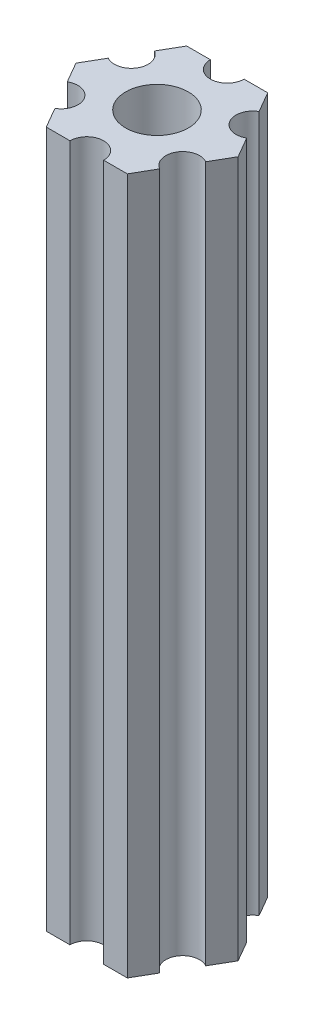
ISO-10303-21;
HEADER;
FILE_DESCRIPTION(('STEP AP214'),'2;1');
FILE_NAME('part.step','',(''),(''),'','','');
FILE_SCHEMA(('AUTOMOTIVE_DESIGN { 1 0 10303 214 1 1 1 1 }'));
ENDSEC;
DATA;
#1=APPLICATION_CONTEXT('core data for automotive mechanical design processes');
#2=APPLICATION_PROTOCOL_DEFINITION('international standard','automotive_design',2000,#1);
#3=PRODUCT_CONTEXT('',#1,'mechanical');
#4=PRODUCT('Part','Part','',(#3));
#5=PRODUCT_RELATED_PRODUCT_CATEGORY('part','',(#4));
#6=PRODUCT_DEFINITION_FORMATION('','',#4);
#7=PRODUCT_DEFINITION_CONTEXT('part definition',#1,'design');
#8=PRODUCT_DEFINITION('design','',#6,#7);
#9=PRODUCT_DEFINITION_SHAPE('','',#8);
#10=(LENGTH_UNIT() NAMED_UNIT(*) SI_UNIT(.MILLI.,.METRE.));
#11=(NAMED_UNIT(*) PLANE_ANGLE_UNIT() SI_UNIT($,.RADIAN.));
#12=(NAMED_UNIT(*) SI_UNIT($,.STERADIAN.) SOLID_ANGLE_UNIT());
#13=UNCERTAINTY_MEASURE_WITH_UNIT(LENGTH_MEASURE(1.E-05),#10,'distance_accuracy_value','');
#14=(GEOMETRIC_REPRESENTATION_CONTEXT(3) GLOBAL_UNCERTAINTY_ASSIGNED_CONTEXT((#13)) GLOBAL_UNIT_ASSIGNED_CONTEXT((#10,
#11,#12)) REPRESENTATION_CONTEXT('',''));
#15=CARTESIAN_POINT('',(0.,0.,0.));
#16=DIRECTION('',(0.,0.,1.));
#17=DIRECTION('',(1.,0.,0.));
#18=AXIS2_PLACEMENT_3D('',#15,#16,#17);
#19=CARTESIAN_POINT('',(5.41265877365274,23.,3.125));
#20=DIRECTION('',(0.,1.,0.));
#21=DIRECTION('',(0.,0.,1.));
#22=AXIS2_PLACEMENT_3D('',#19,#20,#21);
#23=CYLINDRICAL_SURFACE('',#22,1.5);
#24=CARTESIAN_POINT('',(5.41265877365274,85.,3.125));
#25=DIRECTION('',(0.,-1.,0.));
#26=DIRECTION('',(0.,0.,-1.));
#27=AXIS2_PLACEMENT_3D('',#24,#25,#26);
#28=CIRCLE('',#27,1.5);
#29=CARTESIAN_POINT('',(4.66265877365274,85.,4.42403810567666));
#30=VERTEX_POINT('',#29);
#31=CARTESIAN_POINT('',(6.16265877365274,85.,1.82596189432335));
#32=VERTEX_POINT('',#31);
#33=EDGE_CURVE('E194',#30,#32,#28,.T.);
#34=ORIENTED_EDGE('',*,*,#33,.F.);
#35=DIRECTION('',(0.,1.,0.));
#36=VECTOR('',#35,1.);
#37=CARTESIAN_POINT('',(4.66265877365274,23.,4.42403810567666));
#38=LINE('',#37,#36);
#39=CARTESIAN_POINT('',(4.66265877365274,23.,4.42403810567666));
#40=VERTEX_POINT('',#39);
#41=EDGE_CURVE('E11',#40,#30,#38,.T.);
#42=ORIENTED_EDGE('',*,*,#41,.F.);
#43=CARTESIAN_POINT('',(5.41265877365274,23.,3.125));
#44=DIRECTION('',(0.,-1.,0.));
#45=DIRECTION('',(0.,0.,-1.));
#46=AXIS2_PLACEMENT_3D('',#43,#44,#45);
#47=CIRCLE('',#46,1.5);
#48=CARTESIAN_POINT('',(6.16265877365274,23.,1.82596189432335));
#49=VERTEX_POINT('',#48);
#50=EDGE_CURVE('E245',#40,#49,#47,.T.);
#51=ORIENTED_EDGE('',*,*,#50,.T.);
#52=DIRECTION('',(0.,1.,0.));
#53=VECTOR('',#52,1.);
#54=CARTESIAN_POINT('',(6.16265877365274,23.,1.82596189432335));
#55=LINE('',#54,#53);
#56=EDGE_CURVE('E40',#49,#32,#55,.T.);
#57=ORIENTED_EDGE('',*,*,#56,.T.);
#58=EDGE_LOOP('',(#34,#42,#51,#57));
#59=FACE_BOUND('',#58,.T.);
#60=ADVANCED_FACE('F37',(#59),#23,.F.);
#61=CARTESIAN_POINT('',(3.60843918243516,23.,6.25));
#62=DIRECTION('',(0.866025403784439,0.,0.5));
#63=DIRECTION('',(0.5,0.,-0.866025403784439));
#64=AXIS2_PLACEMENT_3D('',#61,#62,#63);
#65=PLANE('',#64);
#66=DIRECTION('',(0.5,0.,-0.866025403784439));
#67=VECTOR('',#66,1.);
#68=CARTESIAN_POINT('',(3.60843918243516,85.,6.25));
#69=LINE('',#68,#67);
#70=CARTESIAN_POINT('',(3.60843918243516,85.,6.25));
#71=VERTEX_POINT('',#70);
#72=EDGE_CURVE('E243',#71,#30,#69,.T.);
#73=ORIENTED_EDGE('',*,*,#72,.F.);
#74=DIRECTION('',(0.,1.,0.));
#75=VECTOR('',#74,1.);
#76=CARTESIAN_POINT('',(3.60843918243516,23.,6.25));
#77=LINE('',#76,#75);
#78=CARTESIAN_POINT('',(3.60843918243516,23.,6.25));
#79=VERTEX_POINT('',#78);
#80=EDGE_CURVE('E46',#79,#71,#77,.T.);
#81=ORIENTED_EDGE('',*,*,#80,.F.);
#82=DIRECTION('',(0.5,0.,-0.866025403784439));
#83=VECTOR('',#82,1.);
#84=CARTESIAN_POINT('',(3.60843918243516,23.,6.25));
#85=LINE('',#84,#83);
#86=EDGE_CURVE('E184',#79,#40,#85,.T.);
#87=ORIENTED_EDGE('',*,*,#86,.T.);
#88=ORIENTED_EDGE('',*,*,#41,.T.);
#89=EDGE_LOOP('',(#73,#81,#87,#88));
#90=FACE_BOUND('',#89,.T.);
#91=ADVANCED_FACE('F277',(#90),#65,.T.);
#92=CARTESIAN_POINT('',(1.5,23.,6.25));
#93=DIRECTION('',(0.,0.,1.));
#94=DIRECTION('',(1.,0.,0.));
#95=AXIS2_PLACEMENT_3D('',#92,#93,#94);
#96=PLANE('',#95);
#97=DIRECTION('',(1.,0.,0.));
#98=VECTOR('',#97,1.);
#99=CARTESIAN_POINT('',(1.5,85.,6.25));
#100=LINE('',#99,#98);
#101=CARTESIAN_POINT('',(1.5,85.,6.25));
#102=VERTEX_POINT('',#101);
#103=EDGE_CURVE('E171',#102,#71,#100,.T.);
#104=ORIENTED_EDGE('',*,*,#103,.F.);
#105=DIRECTION('',(0.,1.,0.));
#106=VECTOR('',#105,1.);
#107=CARTESIAN_POINT('',(1.5,23.,6.25));
#108=LINE('',#107,#106);
#109=CARTESIAN_POINT('',(1.5,23.,6.25));
#110=VERTEX_POINT('',#109);
#111=EDGE_CURVE('E166',#110,#102,#108,.T.);
#112=ORIENTED_EDGE('',*,*,#111,.F.);
#113=DIRECTION('',(1.,0.,0.));
#114=VECTOR('',#113,1.);
#115=CARTESIAN_POINT('',(1.5,23.,6.25));
#116=LINE('',#115,#114);
#117=EDGE_CURVE('E169',#110,#79,#116,.T.);
#118=ORIENTED_EDGE('',*,*,#117,.T.);
#119=ORIENTED_EDGE('',*,*,#80,.T.);
#120=EDGE_LOOP('',(#104,#112,#118,#119));
#121=FACE_BOUND('',#120,.T.);
#122=ADVANCED_FACE('F168',(#121),#96,.T.);
#123=CARTESIAN_POINT('',(0.,23.,6.25));
#124=DIRECTION('',(0.,1.,0.));
#125=DIRECTION('',(0.,0.,1.));
#126=AXIS2_PLACEMENT_3D('',#123,#124,#125);
#127=CYLINDRICAL_SURFACE('',#126,1.5);
#128=CARTESIAN_POINT('',(0.,85.,6.25));
#129=DIRECTION('',(0.,-1.,0.));
#130=DIRECTION('',(0.,0.,-1.));
#131=AXIS2_PLACEMENT_3D('',#128,#129,#130);
#132=CIRCLE('',#131,1.5);
#133=CARTESIAN_POINT('',(-1.5,85.,6.25));
#134=VERTEX_POINT('',#133);
#135=EDGE_CURVE('E240',#134,#102,#132,.T.);
#136=ORIENTED_EDGE('',*,*,#135,.F.);
#137=DIRECTION('',(0.,1.,0.));
#138=VECTOR('',#137,1.);
#139=CARTESIAN_POINT('',(-1.5,23.,6.25));
#140=LINE('',#139,#138);
#141=CARTESIAN_POINT('',(-1.5,23.,6.25));
#142=VERTEX_POINT('',#141);
#143=EDGE_CURVE('E176',#142,#134,#140,.T.);
#144=ORIENTED_EDGE('',*,*,#143,.F.);
#145=CARTESIAN_POINT('',(0.,23.,6.25));
#146=DIRECTION('',(0.,-1.,0.));
#147=DIRECTION('',(0.,0.,-1.));
#148=AXIS2_PLACEMENT_3D('',#145,#146,#147);
#149=CIRCLE('',#148,1.5);
#150=EDGE_CURVE('E182',#142,#110,#149,.T.);
#151=ORIENTED_EDGE('',*,*,#150,.T.);
#152=ORIENTED_EDGE('',*,*,#111,.T.);
#153=EDGE_LOOP('',(#136,#144,#151,#152));
#154=FACE_BOUND('',#153,.T.);
#155=ADVANCED_FACE('F186',(#154),#127,.F.);
#156=CARTESIAN_POINT('',(-3.60843918243516,23.,6.25));
#157=DIRECTION('',(0.,0.,1.));
#158=DIRECTION('',(1.,0.,0.));
#159=AXIS2_PLACEMENT_3D('',#156,#157,#158);
#160=PLANE('',#159);
#161=DIRECTION('',(1.,0.,0.));
#162=VECTOR('',#161,1.);
#163=CARTESIAN_POINT('',(-3.60843918243516,85.,6.25));
#164=LINE('',#163,#162);
#165=CARTESIAN_POINT('',(-3.60843918243516,85.,6.25));
#166=VERTEX_POINT('',#165);
#167=EDGE_CURVE('E237',#166,#134,#164,.T.);
#168=ORIENTED_EDGE('',*,*,#167,.F.);
#169=DIRECTION('',(0.,1.,0.));
#170=VECTOR('',#169,1.);
#171=CARTESIAN_POINT('',(-3.60843918243516,23.,6.25));
#172=LINE('',#171,#170);
#173=CARTESIAN_POINT('',(-3.60843918243516,23.,6.25));
#174=VERTEX_POINT('',#173);
#175=EDGE_CURVE('E249',#174,#166,#172,.T.);
#176=ORIENTED_EDGE('',*,*,#175,.F.);
#177=DIRECTION('',(1.,0.,0.));
#178=VECTOR('',#177,1.);
#179=CARTESIAN_POINT('',(-3.60843918243516,23.,6.25));
#180=LINE('',#179,#178);
#181=EDGE_CURVE('E187',#174,#142,#180,.T.);
#182=ORIENTED_EDGE('',*,*,#181,.T.);
#183=ORIENTED_EDGE('',*,*,#143,.T.);
#184=EDGE_LOOP('',(#168,#176,#182,#183));
#185=FACE_BOUND('',#184,.T.);
#186=ADVANCED_FACE('F290',(#185),#160,.T.);
#187=CARTESIAN_POINT('',(-4.66265877365274,23.,4.42403810567666));
#188=DIRECTION('',(-0.866025403784439,0.,0.5));
#189=DIRECTION('',(0.5,0.,0.866025403784439));
#190=AXIS2_PLACEMENT_3D('',#187,#188,#189);
#191=PLANE('',#190);
#192=DIRECTION('',(0.5,0.,0.866025403784439));
#193=VECTOR('',#192,1.);
#194=CARTESIAN_POINT('',(-4.66265877365274,85.,4.42403810567666));
#195=LINE('',#194,#193);
#196=CARTESIAN_POINT('',(-4.66265877365274,85.,4.42403810567666));
#197=VERTEX_POINT('',#196);
#198=EDGE_CURVE('E234',#197,#166,#195,.T.);
#199=ORIENTED_EDGE('',*,*,#198,.F.);
#200=DIRECTION('',(0.,1.,0.));
#201=VECTOR('',#200,1.);
#202=CARTESIAN_POINT('',(-4.66265877365274,23.,4.42403810567666));
#203=LINE('',#202,#201);
#204=CARTESIAN_POINT('',(-4.66265877365274,23.,4.42403810567666));
#205=VERTEX_POINT('',#204);
#206=EDGE_CURVE('E251',#205,#197,#203,.T.);
#207=ORIENTED_EDGE('',*,*,#206,.F.);
#208=DIRECTION('',(0.5,0.,0.866025403784439));
#209=VECTOR('',#208,1.);
#210=CARTESIAN_POINT('',(-4.66265877365274,23.,4.42403810567666));
#211=LINE('',#210,#209);
#212=EDGE_CURVE('E189',#205,#174,#211,.T.);
#213=ORIENTED_EDGE('',*,*,#212,.T.);
#214=ORIENTED_EDGE('',*,*,#175,.T.);
#215=EDGE_LOOP('',(#199,#207,#213,#214));
#216=FACE_BOUND('',#215,.T.);
#217=ADVANCED_FACE('F293',(#216),#191,.T.);
#218=CARTESIAN_POINT('',(-5.41265877365274,23.,3.125));
#219=DIRECTION('',(0.,1.,0.));
#220=DIRECTION('',(0.,0.,1.));
#221=AXIS2_PLACEMENT_3D('',#218,#219,#220);
#222=CYLINDRICAL_SURFACE('',#221,1.5);
#223=CARTESIAN_POINT('',(-5.41265877365274,85.,3.125));
#224=DIRECTION('',(0.,-1.,0.));
#225=DIRECTION('',(0.,0.,-1.));
#226=AXIS2_PLACEMENT_3D('',#223,#224,#225);
#227=CIRCLE('',#226,1.5);
#228=CARTESIAN_POINT('',(-6.16265877365274,85.,1.82596189432335));
#229=VERTEX_POINT('',#228);
#230=EDGE_CURVE('E231',#229,#197,#227,.T.);
#231=ORIENTED_EDGE('',*,*,#230,.F.);
#232=DIRECTION('',(0.,1.,0.));
#233=VECTOR('',#232,1.);
#234=CARTESIAN_POINT('',(-6.16265877365274,23.,1.82596189432335));
#235=LINE('',#234,#233);
#236=CARTESIAN_POINT('',(-6.16265877365274,23.,1.82596189432335));
#237=VERTEX_POINT('',#236);
#238=EDGE_CURVE('E253',#237,#229,#235,.T.);
#239=ORIENTED_EDGE('',*,*,#238,.F.);
#240=CARTESIAN_POINT('',(-5.41265877365274,23.,3.125));
#241=DIRECTION('',(0.,-1.,0.));
#242=DIRECTION('',(0.,0.,-1.));
#243=AXIS2_PLACEMENT_3D('',#240,#241,#242);
#244=CIRCLE('',#243,1.5);
#245=EDGE_CURVE('E398',#237,#205,#244,.T.);
#246=ORIENTED_EDGE('',*,*,#245,.T.);
#247=ORIENTED_EDGE('',*,*,#206,.T.);
#248=EDGE_LOOP('',(#231,#239,#246,#247));
#249=FACE_BOUND('',#248,.T.);
#250=ADVANCED_FACE('F297',(#249),#222,.F.);
#251=CARTESIAN_POINT('',(-7.21687836487032,23.,0.));
#252=DIRECTION('',(-0.86602540378444,0.,0.499999999999998));
#253=DIRECTION('',(0.499999999999998,0.,0.86602540378444));
#254=AXIS2_PLACEMENT_3D('',#251,#252,#253);
#255=PLANE('',#254);
#256=DIRECTION('',(0.499999999999998,0.,0.86602540378444));
#257=VECTOR('',#256,1.);
#258=CARTESIAN_POINT('',(-7.21687836487032,85.,0.));
#259=LINE('',#258,#257);
#260=CARTESIAN_POINT('',(-7.21687836487032,85.,0.));
#261=VERTEX_POINT('',#260);
#262=EDGE_CURVE('E228',#261,#229,#259,.T.);
#263=ORIENTED_EDGE('',*,*,#262,.F.);
#264=DIRECTION('',(0.,1.,0.));
#265=VECTOR('',#264,1.);
#266=CARTESIAN_POINT('',(-7.21687836487032,23.,0.));
#267=LINE('',#266,#265);
#268=CARTESIAN_POINT('',(-7.21687836487032,23.,0.));
#269=VERTEX_POINT('',#268);
#270=EDGE_CURVE('E255',#269,#261,#267,.T.);
#271=ORIENTED_EDGE('',*,*,#270,.F.);
#272=DIRECTION('',(0.499999999999998,0.,0.86602540378444));
#273=VECTOR('',#272,1.);
#274=CARTESIAN_POINT('',(-7.21687836487032,23.,0.));
#275=LINE('',#274,#273);
#276=EDGE_CURVE('E395',#269,#237,#275,.T.);
#277=ORIENTED_EDGE('',*,*,#276,.T.);
#278=ORIENTED_EDGE('',*,*,#238,.T.);
#279=EDGE_LOOP('',(#263,#271,#277,#278));
#280=FACE_BOUND('',#279,.T.);
#281=ADVANCED_FACE('F301',(#280),#255,.T.);
#282=CARTESIAN_POINT('',(-6.16265877365274,23.,-1.82596189432334));
#283=DIRECTION('',(-0.866025403784438,0.,-0.5));
#284=DIRECTION('',(-0.5,0.,0.866025403784438));
#285=AXIS2_PLACEMENT_3D('',#282,#283,#284);
#286=PLANE('',#285);
#287=DIRECTION('',(-0.5,0.,0.866025403784438));
#288=VECTOR('',#287,1.);
#289=CARTESIAN_POINT('',(-6.16265877365274,85.,-1.82596189432334));
#290=LINE('',#289,#288);
#291=CARTESIAN_POINT('',(-6.16265877365274,85.,-1.82596189432334));
#292=VERTEX_POINT('',#291);
#293=EDGE_CURVE('E225',#292,#261,#290,.T.);
#294=ORIENTED_EDGE('',*,*,#293,.F.);
#295=DIRECTION('',(0.,1.,0.));
#296=VECTOR('',#295,1.);
#297=CARTESIAN_POINT('',(-6.16265877365274,23.,-1.82596189432334));
#298=LINE('',#297,#296);
#299=CARTESIAN_POINT('',(-6.16265877365274,23.,-1.82596189432334));
#300=VERTEX_POINT('',#299);
#301=EDGE_CURVE('E257',#300,#292,#298,.T.);
#302=ORIENTED_EDGE('',*,*,#301,.F.);
#303=DIRECTION('',(-0.5,0.,0.866025403784438));
#304=VECTOR('',#303,1.);
#305=CARTESIAN_POINT('',(-6.16265877365274,23.,-1.82596189432334));
#306=LINE('',#305,#304);
#307=EDGE_CURVE('E392',#300,#269,#306,.T.);
#308=ORIENTED_EDGE('',*,*,#307,.T.);
#309=ORIENTED_EDGE('',*,*,#270,.T.);
#310=EDGE_LOOP('',(#294,#302,#308,#309));
#311=FACE_BOUND('',#310,.T.);
#312=ADVANCED_FACE('F305',(#311),#286,.T.);
#313=CARTESIAN_POINT('',(-5.41265877365274,23.,-3.125));
#314=DIRECTION('',(0.,1.,0.));
#315=DIRECTION('',(0.,0.,1.));
#316=AXIS2_PLACEMENT_3D('',#313,#314,#315);
#317=CYLINDRICAL_SURFACE('',#316,1.5);
#318=CARTESIAN_POINT('',(-5.41265877365274,85.,-3.125));
#319=DIRECTION('',(0.,-1.,0.));
#320=DIRECTION('',(0.,0.,-1.));
#321=AXIS2_PLACEMENT_3D('',#318,#319,#320);
#322=CIRCLE('',#321,1.5);
#323=CARTESIAN_POINT('',(-4.66265877365274,85.,-4.42403810567666));
#324=VERTEX_POINT('',#323);
#325=EDGE_CURVE('E222',#324,#292,#322,.T.);
#326=ORIENTED_EDGE('',*,*,#325,.F.);
#327=DIRECTION('',(0.,1.,0.));
#328=VECTOR('',#327,1.);
#329=CARTESIAN_POINT('',(-4.66265877365274,23.,-4.42403810567666));
#330=LINE('',#329,#328);
#331=CARTESIAN_POINT('',(-4.66265877365274,23.,-4.42403810567666));
#332=VERTEX_POINT('',#331);
#333=EDGE_CURVE('E259',#332,#324,#330,.T.);
#334=ORIENTED_EDGE('',*,*,#333,.F.);
#335=CARTESIAN_POINT('',(-5.41265877365274,23.,-3.125));
#336=DIRECTION('',(0.,-1.,0.));
#337=DIRECTION('',(0.,0.,-1.));
#338=AXIS2_PLACEMENT_3D('',#335,#336,#337);
#339=CIRCLE('',#338,1.5);
#340=EDGE_CURVE('E389',#332,#300,#339,.T.);
#341=ORIENTED_EDGE('',*,*,#340,.T.);
#342=ORIENTED_EDGE('',*,*,#301,.T.);
#343=EDGE_LOOP('',(#326,#334,#341,#342));
#344=FACE_BOUND('',#343,.T.);
#345=ADVANCED_FACE('F309',(#344),#317,.F.);
#346=CARTESIAN_POINT('',(-3.60843918243516,23.,-6.25));
#347=DIRECTION('',(-0.866025403784439,0.,-0.5));
#348=DIRECTION('',(-0.5,0.,0.866025403784439));
#349=AXIS2_PLACEMENT_3D('',#346,#347,#348);
#350=PLANE('',#349);
#351=DIRECTION('',(-0.5,0.,0.866025403784439));
#352=VECTOR('',#351,1.);
#353=CARTESIAN_POINT('',(-3.60843918243516,85.,-6.25));
#354=LINE('',#353,#352);
#355=CARTESIAN_POINT('',(-3.60843918243516,85.,-6.25));
#356=VERTEX_POINT('',#355);
#357=EDGE_CURVE('E219',#356,#324,#354,.T.);
#358=ORIENTED_EDGE('',*,*,#357,.F.);
#359=DIRECTION('',(0.,1.,0.));
#360=VECTOR('',#359,1.);
#361=CARTESIAN_POINT('',(-3.60843918243516,23.,-6.25));
#362=LINE('',#361,#360);
#363=CARTESIAN_POINT('',(-3.60843918243516,23.,-6.25));
#364=VERTEX_POINT('',#363);
#365=EDGE_CURVE('E261',#364,#356,#362,.T.);
#366=ORIENTED_EDGE('',*,*,#365,.F.);
#367=DIRECTION('',(-0.5,0.,0.866025403784439));
#368=VECTOR('',#367,1.);
#369=CARTESIAN_POINT('',(-3.60843918243516,23.,-6.25));
#370=LINE('',#369,#368);
#371=EDGE_CURVE('E386',#364,#332,#370,.T.);
#372=ORIENTED_EDGE('',*,*,#371,.T.);
#373=ORIENTED_EDGE('',*,*,#333,.T.);
#374=EDGE_LOOP('',(#358,#366,#372,#373));
#375=FACE_BOUND('',#374,.T.);
#376=ADVANCED_FACE('F313',(#375),#350,.T.);
#377=CARTESIAN_POINT('',(-1.5,23.,-6.25));
#378=DIRECTION('',(0.,0.,-1.));
#379=DIRECTION('',(-1.,0.,0.));
#380=AXIS2_PLACEMENT_3D('',#377,#378,#379);
#381=PLANE('',#380);
#382=DIRECTION('',(-1.,0.,0.));
#383=VECTOR('',#382,1.);
#384=CARTESIAN_POINT('',(-1.5,85.,-6.25));
#385=LINE('',#384,#383);
#386=CARTESIAN_POINT('',(-1.5,85.,-6.25));
#387=VERTEX_POINT('',#386);
#388=EDGE_CURVE('E216',#387,#356,#385,.T.);
#389=ORIENTED_EDGE('',*,*,#388,.F.);
#390=DIRECTION('',(0.,1.,0.));
#391=VECTOR('',#390,1.);
#392=CARTESIAN_POINT('',(-1.5,23.,-6.25));
#393=LINE('',#392,#391);
#394=CARTESIAN_POINT('',(-1.5,23.,-6.25));
#395=VERTEX_POINT('',#394);
#396=EDGE_CURVE('E263',#395,#387,#393,.T.);
#397=ORIENTED_EDGE('',*,*,#396,.F.);
#398=DIRECTION('',(-1.,0.,0.));
#399=VECTOR('',#398,1.);
#400=CARTESIAN_POINT('',(-1.5,23.,-6.25));
#401=LINE('',#400,#399);
#402=EDGE_CURVE('E383',#395,#364,#401,.T.);
#403=ORIENTED_EDGE('',*,*,#402,.T.);
#404=ORIENTED_EDGE('',*,*,#365,.T.);
#405=EDGE_LOOP('',(#389,#397,#403,#404));
#406=FACE_BOUND('',#405,.T.);
#407=ADVANCED_FACE('F317',(#406),#381,.T.);
#408=CARTESIAN_POINT('',(0.,23.,-6.25));
#409=DIRECTION('',(0.,1.,0.));
#410=DIRECTION('',(0.,0.,1.));
#411=AXIS2_PLACEMENT_3D('',#408,#409,#410);
#412=CYLINDRICAL_SURFACE('',#411,1.5);
#413=CARTESIAN_POINT('',(0.,85.,-6.25));
#414=DIRECTION('',(0.,-1.,0.));
#415=DIRECTION('',(0.,0.,-1.));
#416=AXIS2_PLACEMENT_3D('',#413,#414,#415);
#417=CIRCLE('',#416,1.5);
#418=CARTESIAN_POINT('',(1.5,85.,-6.25));
#419=VERTEX_POINT('',#418);
#420=EDGE_CURVE('E213',#419,#387,#417,.T.);
#421=ORIENTED_EDGE('',*,*,#420,.F.);
#422=DIRECTION('',(0.,1.,0.));
#423=VECTOR('',#422,1.);
#424=CARTESIAN_POINT('',(1.5,23.,-6.25));
#425=LINE('',#424,#423);
#426=CARTESIAN_POINT('',(1.5,23.,-6.25));
#427=VERTEX_POINT('',#426);
#428=EDGE_CURVE('E265',#427,#419,#425,.T.);
#429=ORIENTED_EDGE('',*,*,#428,.F.);
#430=CARTESIAN_POINT('',(0.,23.,-6.25));
#431=DIRECTION('',(0.,-1.,0.));
#432=DIRECTION('',(0.,0.,-1.));
#433=AXIS2_PLACEMENT_3D('',#430,#431,#432);
#434=CIRCLE('',#433,1.5);
#435=EDGE_CURVE('E380',#427,#395,#434,.T.);
#436=ORIENTED_EDGE('',*,*,#435,.T.);
#437=ORIENTED_EDGE('',*,*,#396,.T.);
#438=EDGE_LOOP('',(#421,#429,#436,#437));
#439=FACE_BOUND('',#438,.T.);
#440=ADVANCED_FACE('F321',(#439),#412,.F.);
#441=CARTESIAN_POINT('',(3.60843918243516,23.,-6.25));
#442=DIRECTION('',(0.,0.,-1.));
#443=DIRECTION('',(-1.,0.,0.));
#444=AXIS2_PLACEMENT_3D('',#441,#442,#443);
#445=PLANE('',#444);
#446=DIRECTION('',(-1.,0.,0.));
#447=VECTOR('',#446,1.);
#448=CARTESIAN_POINT('',(3.60843918243516,85.,-6.25));
#449=LINE('',#448,#447);
#450=CARTESIAN_POINT('',(3.60843918243516,85.,-6.25));
#451=VERTEX_POINT('',#450);
#452=EDGE_CURVE('E210',#451,#419,#449,.T.);
#453=ORIENTED_EDGE('',*,*,#452,.F.);
#454=DIRECTION('',(0.,1.,0.));
#455=VECTOR('',#454,1.);
#456=CARTESIAN_POINT('',(3.60843918243516,23.,-6.25));
#457=LINE('',#456,#455);
#458=CARTESIAN_POINT('',(3.60843918243516,23.,-6.25));
#459=VERTEX_POINT('',#458);
#460=EDGE_CURVE('E267',#459,#451,#457,.T.);
#461=ORIENTED_EDGE('',*,*,#460,.F.);
#462=DIRECTION('',(-1.,0.,0.));
#463=VECTOR('',#462,1.);
#464=CARTESIAN_POINT('',(3.60843918243516,23.,-6.25));
#465=LINE('',#464,#463);
#466=EDGE_CURVE('E377',#459,#427,#465,.T.);
#467=ORIENTED_EDGE('',*,*,#466,.T.);
#468=ORIENTED_EDGE('',*,*,#428,.T.);
#469=EDGE_LOOP('',(#453,#461,#467,#468));
#470=FACE_BOUND('',#469,.T.);
#471=ADVANCED_FACE('F325',(#470),#445,.T.);
#472=CARTESIAN_POINT('',(4.66265877365274,23.,-4.42403810567666));
#473=DIRECTION('',(0.866025403784439,0.,-0.5));
#474=DIRECTION('',(-0.5,0.,-0.866025403784439));
#475=AXIS2_PLACEMENT_3D('',#472,#473,#474);
#476=PLANE('',#475);
#477=DIRECTION('',(-0.5,0.,-0.866025403784439));
#478=VECTOR('',#477,1.);
#479=CARTESIAN_POINT('',(4.66265877365274,85.,-4.42403810567666));
#480=LINE('',#479,#478);
#481=CARTESIAN_POINT('',(4.66265877365274,85.,-4.42403810567666));
#482=VERTEX_POINT('',#481);
#483=EDGE_CURVE('E207',#482,#451,#480,.T.);
#484=ORIENTED_EDGE('',*,*,#483,.F.);
#485=DIRECTION('',(0.,1.,0.));
#486=VECTOR('',#485,1.);
#487=CARTESIAN_POINT('',(4.66265877365274,23.,-4.42403810567666));
#488=LINE('',#487,#486);
#489=CARTESIAN_POINT('',(4.66265877365274,23.,-4.42403810567666));
#490=VERTEX_POINT('',#489);
#491=EDGE_CURVE('E269',#490,#482,#488,.T.);
#492=ORIENTED_EDGE('',*,*,#491,.F.);
#493=DIRECTION('',(-0.5,0.,-0.866025403784439));
#494=VECTOR('',#493,1.);
#495=CARTESIAN_POINT('',(4.66265877365274,23.,-4.42403810567666));
#496=LINE('',#495,#494);
#497=EDGE_CURVE('E374',#490,#459,#496,.T.);
#498=ORIENTED_EDGE('',*,*,#497,.T.);
#499=ORIENTED_EDGE('',*,*,#460,.T.);
#500=EDGE_LOOP('',(#484,#492,#498,#499));
#501=FACE_BOUND('',#500,.T.);
#502=ADVANCED_FACE('F329',(#501),#476,.T.);
#503=CARTESIAN_POINT('',(5.41265877365274,23.,-3.125));
#504=DIRECTION('',(0.,1.,0.));
#505=DIRECTION('',(0.,0.,1.));
#506=AXIS2_PLACEMENT_3D('',#503,#504,#505);
#507=CYLINDRICAL_SURFACE('',#506,1.5);
#508=CARTESIAN_POINT('',(5.41265877365274,85.,-3.125));
#509=DIRECTION('',(0.,-1.,0.));
#510=DIRECTION('',(0.,0.,-1.));
#511=AXIS2_PLACEMENT_3D('',#508,#509,#510);
#512=CIRCLE('',#511,1.5);
#513=CARTESIAN_POINT('',(6.16265877365274,85.,-1.82596189432334));
#514=VERTEX_POINT('',#513);
#515=EDGE_CURVE('E204',#514,#482,#512,.T.);
#516=ORIENTED_EDGE('',*,*,#515,.F.);
#517=DIRECTION('',(0.,1.,0.));
#518=VECTOR('',#517,1.);
#519=CARTESIAN_POINT('',(6.16265877365274,23.,-1.82596189432334));
#520=LINE('',#519,#518);
#521=CARTESIAN_POINT('',(6.16265877365274,23.,-1.82596189432334));
#522=VERTEX_POINT('',#521);
#523=EDGE_CURVE('E271',#522,#514,#520,.T.);
#524=ORIENTED_EDGE('',*,*,#523,.F.);
#525=CARTESIAN_POINT('',(5.41265877365274,23.,-3.125));
#526=DIRECTION('',(0.,-1.,0.));
#527=DIRECTION('',(0.,0.,-1.));
#528=AXIS2_PLACEMENT_3D('',#525,#526,#527);
#529=CIRCLE('',#528,1.5);
#530=EDGE_CURVE('E371',#522,#490,#529,.T.);
#531=ORIENTED_EDGE('',*,*,#530,.T.);
#532=ORIENTED_EDGE('',*,*,#491,.T.);
#533=EDGE_LOOP('',(#516,#524,#531,#532));
#534=FACE_BOUND('',#533,.T.);
#535=ADVANCED_FACE('F333',(#534),#507,.F.);
#536=CARTESIAN_POINT('',(7.21687836487032,23.,0.));
#537=DIRECTION('',(0.866025403784439,0.,-0.5));
#538=DIRECTION('',(-0.5,0.,-0.866025403784439));
#539=AXIS2_PLACEMENT_3D('',#536,#537,#538);
#540=PLANE('',#539);
#541=DIRECTION('',(-0.5,0.,-0.866025403784439));
#542=VECTOR('',#541,1.);
#543=CARTESIAN_POINT('',(7.21687836487032,85.,0.));
#544=LINE('',#543,#542);
#545=CARTESIAN_POINT('',(7.21687836487032,85.,0.));
#546=VERTEX_POINT('',#545);
#547=EDGE_CURVE('E201',#546,#514,#544,.T.);
#548=ORIENTED_EDGE('',*,*,#547,.F.);
#549=DIRECTION('',(0.,1.,0.));
#550=VECTOR('',#549,1.);
#551=CARTESIAN_POINT('',(7.21687836487032,23.,0.));
#552=LINE('',#551,#550);
#553=CARTESIAN_POINT('',(7.21687836487032,23.,0.));
#554=VERTEX_POINT('',#553);
#555=EDGE_CURVE('E272',#554,#546,#552,.T.);
#556=ORIENTED_EDGE('',*,*,#555,.F.);
#557=DIRECTION('',(-0.5,0.,-0.866025403784439));
#558=VECTOR('',#557,1.);
#559=CARTESIAN_POINT('',(7.21687836487032,23.,0.));
#560=LINE('',#559,#558);
#561=EDGE_CURVE('E368',#554,#522,#560,.T.);
#562=ORIENTED_EDGE('',*,*,#561,.T.);
#563=ORIENTED_EDGE('',*,*,#523,.T.);
#564=EDGE_LOOP('',(#548,#556,#562,#563));
#565=FACE_BOUND('',#564,.T.);
#566=ADVANCED_FACE('F337',(#565),#540,.T.);
#567=CARTESIAN_POINT('',(6.16265877365274,23.,1.82596189432335));
#568=DIRECTION('',(0.86602540378444,0.,0.499999999999999));
#569=DIRECTION('',(0.499999999999999,0.,-0.86602540378444));
#570=AXIS2_PLACEMENT_3D('',#567,#568,#569);
#571=PLANE('',#570);
#572=DIRECTION('',(0.499999999999999,0.,-0.86602540378444));
#573=VECTOR('',#572,1.);
#574=CARTESIAN_POINT('',(6.16265877365274,85.,1.82596189432335));
#575=LINE('',#574,#573);
#576=EDGE_CURVE('E197',#32,#546,#575,.T.);
#577=ORIENTED_EDGE('',*,*,#576,.F.);
#578=ORIENTED_EDGE('',*,*,#56,.F.);
#579=DIRECTION('',(0.499999999999999,0.,-0.86602540378444));
#580=VECTOR('',#579,1.);
#581=CARTESIAN_POINT('',(6.16265877365274,23.,1.82596189432335));
#582=LINE('',#581,#580);
#583=EDGE_CURVE('E366',#49,#554,#582,.T.);
#584=ORIENTED_EDGE('',*,*,#583,.T.);
#585=ORIENTED_EDGE('',*,*,#555,.T.);
#586=EDGE_LOOP('',(#577,#578,#584,#585));
#587=FACE_BOUND('',#586,.T.);
#588=ADVANCED_FACE('F274',(#587),#571,.T.);
#589=CARTESIAN_POINT('',(5.41265877365274,23.,3.125));
#590=DIRECTION('',(0.,-1.,0.));
#591=DIRECTION('',(0.,0.,-1.));
#592=AXIS2_PLACEMENT_3D('',#589,#590,#591);
#593=PLANE('',#592);
#594=CARTESIAN_POINT('',(0.,23.,0.));
#595=DIRECTION('',(0.,1.,0.));
#596=DIRECTION('',(0.,0.,-1.));
#597=AXIS2_PLACEMENT_3D('',#594,#595,#596);
#598=CIRCLE('',#597,2.79);
#599=CARTESIAN_POINT('',(0.,23.,-2.79));
#600=VERTEX_POINT('',#599);
#601=EDGE_CURVE('E198',#600,#600,#598,.T.);
#602=ORIENTED_EDGE('',*,*,#601,.T.);
#603=EDGE_LOOP('',(#602));
#604=FACE_BOUND('',#603,.T.);
#605=ORIENTED_EDGE('',*,*,#50,.F.);
#606=ORIENTED_EDGE('',*,*,#86,.F.);
#607=ORIENTED_EDGE('',*,*,#117,.F.);
#608=ORIENTED_EDGE('',*,*,#150,.F.);
#609=ORIENTED_EDGE('',*,*,#181,.F.);
#610=ORIENTED_EDGE('',*,*,#212,.F.);
#611=ORIENTED_EDGE('',*,*,#245,.F.);
#612=ORIENTED_EDGE('',*,*,#276,.F.);
#613=ORIENTED_EDGE('',*,*,#307,.F.);
#614=ORIENTED_EDGE('',*,*,#340,.F.);
#615=ORIENTED_EDGE('',*,*,#371,.F.);
#616=ORIENTED_EDGE('',*,*,#402,.F.);
#617=ORIENTED_EDGE('',*,*,#435,.F.);
#618=ORIENTED_EDGE('',*,*,#466,.F.);
#619=ORIENTED_EDGE('',*,*,#497,.F.);
#620=ORIENTED_EDGE('',*,*,#530,.F.);
#621=ORIENTED_EDGE('',*,*,#561,.F.);
#622=ORIENTED_EDGE('',*,*,#583,.F.);
#623=EDGE_LOOP('',(#605,#606,#607,#608,#609,#610,#611,#612,#613,#614,#615,#616,#617,#618,#619,
#620,#621,#622));
#624=FACE_BOUND('',#623,.T.);
#625=ADVANCED_FACE('F180',(#604,#624),#593,.T.);
#626=CARTESIAN_POINT('',(5.41265877365274,85.,3.125));
#627=DIRECTION('',(0.,-1.,0.));
#628=DIRECTION('',(0.,0.,-1.));
#629=AXIS2_PLACEMENT_3D('',#626,#627,#628);
#630=PLANE('',#629);
#631=CARTESIAN_POINT('',(0.,85.,0.));
#632=DIRECTION('',(0.,1.,0.));
#633=DIRECTION('',(0.,0.,-1.));
#634=AXIS2_PLACEMENT_3D('',#631,#632,#633);
#635=CIRCLE('',#634,2.79);
#636=CARTESIAN_POINT('',(0.,85.,-2.79));
#637=VERTEX_POINT('',#636);
#638=EDGE_CURVE('E361',#637,#637,#635,.T.);
#639=ORIENTED_EDGE('',*,*,#638,.F.);
#640=EDGE_LOOP('',(#639));
#641=FACE_BOUND('',#640,.T.);
#642=ORIENTED_EDGE('',*,*,#33,.T.);
#643=ORIENTED_EDGE('',*,*,#576,.T.);
#644=ORIENTED_EDGE('',*,*,#547,.T.);
#645=ORIENTED_EDGE('',*,*,#515,.T.);
#646=ORIENTED_EDGE('',*,*,#483,.T.);
#647=ORIENTED_EDGE('',*,*,#452,.T.);
#648=ORIENTED_EDGE('',*,*,#420,.T.);
#649=ORIENTED_EDGE('',*,*,#388,.T.);
#650=ORIENTED_EDGE('',*,*,#357,.T.);
#651=ORIENTED_EDGE('',*,*,#325,.T.);
#652=ORIENTED_EDGE('',*,*,#293,.T.);
#653=ORIENTED_EDGE('',*,*,#262,.T.);
#654=ORIENTED_EDGE('',*,*,#230,.T.);
#655=ORIENTED_EDGE('',*,*,#198,.T.);
#656=ORIENTED_EDGE('',*,*,#167,.T.);
#657=ORIENTED_EDGE('',*,*,#135,.T.);
#658=ORIENTED_EDGE('',*,*,#103,.T.);
#659=ORIENTED_EDGE('',*,*,#72,.T.);
#660=EDGE_LOOP('',(#642,#643,#644,#645,#646,#647,#648,#649,#650,#651,#652,#653,#654,#655,#656,
#657,#658,#659));
#661=FACE_BOUND('',#660,.T.);
#662=ADVANCED_FACE('F276',(#641,#661),#630,.F.);
#663=CARTESIAN_POINT('',(0.,23.,0.));
#664=DIRECTION('',(0.,1.,0.));
#665=DIRECTION('',(0.,0.,1.));
#666=AXIS2_PLACEMENT_3D('',#663,#664,#665);
#667=CYLINDRICAL_SURFACE('',#666,2.79);
#668=ORIENTED_EDGE('',*,*,#601,.F.);
#669=EDGE_LOOP('',(#668));
#670=FACE_BOUND('',#669,.T.);
#671=ORIENTED_EDGE('',*,*,#638,.T.);
#672=EDGE_LOOP('',(#671));
#673=FACE_BOUND('',#672,.T.);
#674=ADVANCED_FACE('F349',(#670,#673),#667,.F.);
#675=CLOSED_SHELL('',(#60,#91,#122,#155,#186,#217,#250,#281,#312,#345,#376,#407,#440,#471,#502,
#535,#566,#588,#625,#662,#674));
#676=MANIFOLD_SOLID_BREP('B2',#675);
#677=ADVANCED_BREP_SHAPE_REPRESENTATION('',(#18,#676),#14);
#678=SHAPE_DEFINITION_REPRESENTATION(#9,#677);
ENDSEC;
END-ISO-10303-21;
